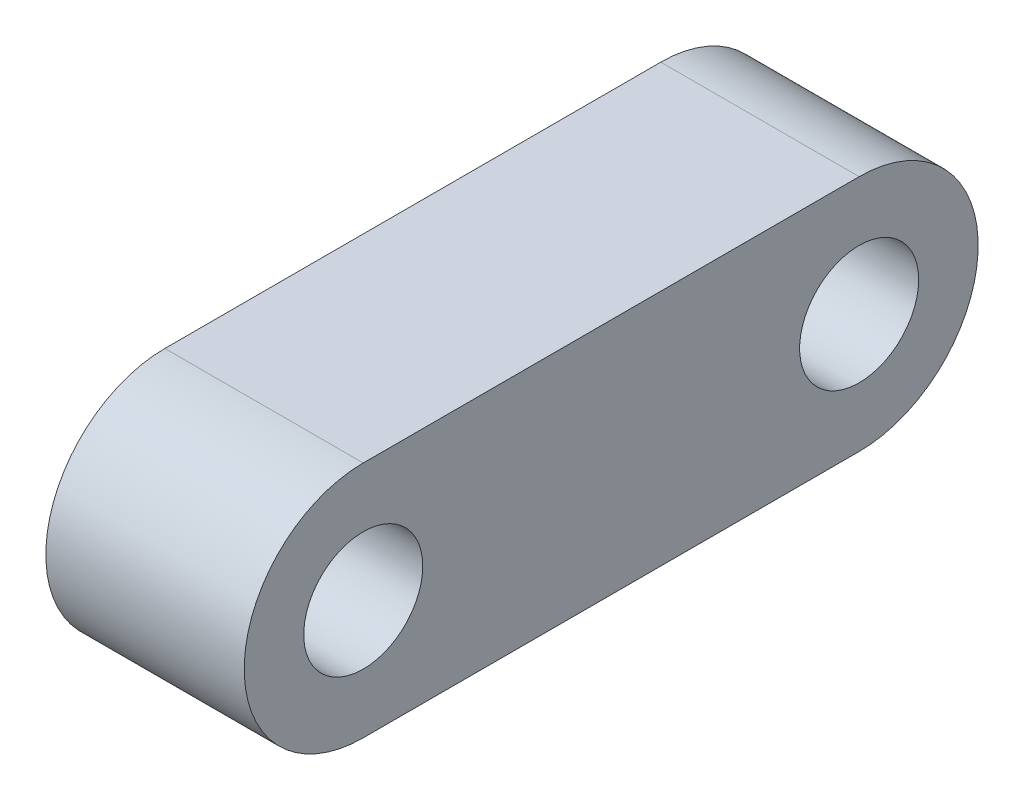
ISO-10303-21;
HEADER;
FILE_DESCRIPTION(('STEP AP214'),'2;1');
FILE_NAME('part.step','',(''),(''),'','','');
FILE_SCHEMA(('AUTOMOTIVE_DESIGN { 1 0 10303 214 1 1 1 1 }'));
ENDSEC;
DATA;
#1=APPLICATION_CONTEXT('core data for automotive mechanical design processes');
#2=APPLICATION_PROTOCOL_DEFINITION('international standard','automotive_design',2000,#1);
#3=PRODUCT_CONTEXT('',#1,'mechanical');
#4=PRODUCT('Part','Part','',(#3));
#5=PRODUCT_RELATED_PRODUCT_CATEGORY('part','',(#4));
#6=PRODUCT_DEFINITION_FORMATION('','',#4);
#7=PRODUCT_DEFINITION_CONTEXT('part definition',#1,'design');
#8=PRODUCT_DEFINITION('design','',#6,#7);
#9=PRODUCT_DEFINITION_SHAPE('','',#8);
#10=(LENGTH_UNIT() NAMED_UNIT(*) SI_UNIT(.MILLI.,.METRE.));
#11=(NAMED_UNIT(*) PLANE_ANGLE_UNIT() SI_UNIT($,.RADIAN.));
#12=(NAMED_UNIT(*) SI_UNIT($,.STERADIAN.) SOLID_ANGLE_UNIT());
#13=UNCERTAINTY_MEASURE_WITH_UNIT(LENGTH_MEASURE(1.E-05),#10,'distance_accuracy_value','');
#14=(GEOMETRIC_REPRESENTATION_CONTEXT(3) GLOBAL_UNCERTAINTY_ASSIGNED_CONTEXT((#13)) GLOBAL_UNIT_ASSIGNED_CONTEXT((#10,
#11,#12)) REPRESENTATION_CONTEXT('',''));
#15=CARTESIAN_POINT('',(0.,0.,0.));
#16=DIRECTION('',(0.,0.,1.));
#17=DIRECTION('',(1.,0.,0.));
#18=AXIS2_PLACEMENT_3D('',#15,#16,#17);
#19=CARTESIAN_POINT('',(2.5,0.,6.25));
#20=DIRECTION('',(1.,0.,0.));
#21=DIRECTION('',(0.,0.,-1.));
#22=AXIS2_PLACEMENT_3D('',#19,#20,#21);
#23=PLANE('',#22);
#24=CARTESIAN_POINT('',(2.5,0.,-6.25));
#25=DIRECTION('',(1.,0.,0.));
#26=DIRECTION('',(0.,0.,-1.));
#27=AXIS2_PLACEMENT_3D('',#24,#25,#26);
#28=CIRCLE('',#27,1.5);
#29=CARTESIAN_POINT('',(2.5,0.,-7.75));
#30=VERTEX_POINT('',#29);
#31=EDGE_CURVE('E106',#30,#30,#28,.T.);
#32=ORIENTED_EDGE('',*,*,#31,.F.);
#33=EDGE_LOOP('',(#32));
#34=FACE_BOUND('',#33,.T.);
#35=CARTESIAN_POINT('',(2.5,0.,6.25));
#36=DIRECTION('',(1.,0.,0.));
#37=DIRECTION('',(0.,0.,-1.));
#38=AXIS2_PLACEMENT_3D('',#35,#36,#37);
#39=CIRCLE('',#38,3.);
#40=CARTESIAN_POINT('',(2.5,3.,6.25));
#41=VERTEX_POINT('',#40);
#42=CARTESIAN_POINT('',(2.5,-3.,6.25));
#43=VERTEX_POINT('',#42);
#44=EDGE_CURVE('E91',#41,#43,#39,.T.);
#45=ORIENTED_EDGE('',*,*,#44,.T.);
#46=DIRECTION('',(0.,0.,-1.));
#47=VECTOR('',#46,1.);
#48=CARTESIAN_POINT('',(2.5,-3.,6.25));
#49=LINE('',#48,#47);
#50=CARTESIAN_POINT('',(2.5,-3.,-6.25));
#51=VERTEX_POINT('',#50);
#52=EDGE_CURVE('E86',#43,#51,#49,.T.);
#53=ORIENTED_EDGE('',*,*,#52,.T.);
#54=CARTESIAN_POINT('',(2.5,0.,-6.25));
#55=DIRECTION('',(1.,0.,0.));
#56=DIRECTION('',(0.,0.,-1.));
#57=AXIS2_PLACEMENT_3D('',#54,#55,#56);
#58=CIRCLE('',#57,3.);
#59=CARTESIAN_POINT('',(2.5,3.,-6.25));
#60=VERTEX_POINT('',#59);
#61=EDGE_CURVE('E89',#51,#60,#58,.T.);
#62=ORIENTED_EDGE('',*,*,#61,.T.);
#63=DIRECTION('',(0.,0.,1.));
#64=VECTOR('',#63,1.);
#65=CARTESIAN_POINT('',(2.5,3.,6.25));
#66=LINE('',#65,#64);
#67=EDGE_CURVE('E56',#60,#41,#66,.T.);
#68=ORIENTED_EDGE('',*,*,#67,.T.);
#69=EDGE_LOOP('',(#45,#53,#62,#68));
#70=FACE_BOUND('',#69,.T.);
#71=CARTESIAN_POINT('',(2.5,0.,6.25));
#72=DIRECTION('',(1.,0.,0.));
#73=DIRECTION('',(0.,0.,-1.));
#74=AXIS2_PLACEMENT_3D('',#71,#72,#73);
#75=CIRCLE('',#74,1.5);
#76=CARTESIAN_POINT('',(2.5,0.,4.75));
#77=VERTEX_POINT('',#76);
#78=EDGE_CURVE('E121',#77,#77,#75,.T.);
#79=ORIENTED_EDGE('',*,*,#78,.F.);
#80=EDGE_LOOP('',(#79));
#81=FACE_BOUND('',#80,.T.);
#82=ADVANCED_FACE('F39',(#34,#70,#81),#23,.T.);
#83=CARTESIAN_POINT('',(-2.5,0.,6.25));
#84=DIRECTION('',(1.,0.,0.));
#85=DIRECTION('',(0.,0.,-1.));
#86=AXIS2_PLACEMENT_3D('',#83,#84,#85);
#87=PLANE('',#86);
#88=CARTESIAN_POINT('',(-2.5,0.,6.25));
#89=DIRECTION('',(1.,0.,0.));
#90=DIRECTION('',(0.,0.,-1.));
#91=AXIS2_PLACEMENT_3D('',#88,#89,#90);
#92=CIRCLE('',#91,3.);
#93=CARTESIAN_POINT('',(-2.5,3.,6.25));
#94=VERTEX_POINT('',#93);
#95=CARTESIAN_POINT('',(-2.5,-3.,6.25));
#96=VERTEX_POINT('',#95);
#97=EDGE_CURVE('E103',#94,#96,#92,.T.);
#98=ORIENTED_EDGE('',*,*,#97,.F.);
#99=DIRECTION('',(0.,0.,1.));
#100=VECTOR('',#99,1.);
#101=CARTESIAN_POINT('',(-2.5,3.,6.25));
#102=LINE('',#101,#100);
#103=CARTESIAN_POINT('',(-2.5,3.,-6.25));
#104=VERTEX_POINT('',#103);
#105=EDGE_CURVE('E79',#104,#94,#102,.T.);
#106=ORIENTED_EDGE('',*,*,#105,.F.);
#107=CARTESIAN_POINT('',(-2.5,0.,-6.25));
#108=DIRECTION('',(1.,0.,0.));
#109=DIRECTION('',(0.,0.,-1.));
#110=AXIS2_PLACEMENT_3D('',#107,#108,#109);
#111=CIRCLE('',#110,3.);
#112=CARTESIAN_POINT('',(-2.5,-3.,-6.25));
#113=VERTEX_POINT('',#112);
#114=EDGE_CURVE('E73',#113,#104,#111,.T.);
#115=ORIENTED_EDGE('',*,*,#114,.F.);
#116=DIRECTION('',(0.,0.,-1.));
#117=VECTOR('',#116,1.);
#118=CARTESIAN_POINT('',(-2.5,-3.,6.25));
#119=LINE('',#118,#117);
#120=EDGE_CURVE('E95',#96,#113,#119,.T.);
#121=ORIENTED_EDGE('',*,*,#120,.F.);
#122=EDGE_LOOP('',(#98,#106,#115,#121));
#123=FACE_BOUND('',#122,.T.);
#124=CARTESIAN_POINT('',(-2.5,0.,-6.25));
#125=DIRECTION('',(1.,0.,0.));
#126=DIRECTION('',(0.,0.,-1.));
#127=AXIS2_PLACEMENT_3D('',#124,#125,#126);
#128=CIRCLE('',#127,1.5);
#129=CARTESIAN_POINT('',(-2.5,0.,-7.75));
#130=VERTEX_POINT('',#129);
#131=EDGE_CURVE('E118',#130,#130,#128,.T.);
#132=ORIENTED_EDGE('',*,*,#131,.T.);
#133=EDGE_LOOP('',(#132));
#134=FACE_BOUND('',#133,.T.);
#135=CARTESIAN_POINT('',(-2.5,0.,6.25));
#136=DIRECTION('',(1.,0.,0.));
#137=DIRECTION('',(0.,0.,-1.));
#138=AXIS2_PLACEMENT_3D('',#135,#136,#137);
#139=CIRCLE('',#138,1.5);
#140=CARTESIAN_POINT('',(-2.5,0.,4.75));
#141=VERTEX_POINT('',#140);
#142=EDGE_CURVE('E124',#141,#141,#139,.T.);
#143=ORIENTED_EDGE('',*,*,#142,.T.);
#144=EDGE_LOOP('',(#143));
#145=FACE_BOUND('',#144,.T.);
#146=ADVANCED_FACE('F114',(#123,#134,#145),#87,.F.);
#147=CARTESIAN_POINT('',(2.5,0.,6.25));
#148=DIRECTION('',(-1.,0.,0.));
#149=DIRECTION('',(0.,0.,1.));
#150=AXIS2_PLACEMENT_3D('',#147,#148,#149);
#151=CYLINDRICAL_SURFACE('',#150,3.);
#152=ORIENTED_EDGE('',*,*,#97,.T.);
#153=DIRECTION('',(-1.,0.,0.));
#154=VECTOR('',#153,1.);
#155=CARTESIAN_POINT('',(2.5,-3.,6.25));
#156=LINE('',#155,#154);
#157=EDGE_CURVE('E11',#43,#96,#156,.T.);
#158=ORIENTED_EDGE('',*,*,#157,.F.);
#159=ORIENTED_EDGE('',*,*,#44,.F.);
#160=DIRECTION('',(-1.,0.,0.));
#161=VECTOR('',#160,1.);
#162=CARTESIAN_POINT('',(2.5,3.,6.25));
#163=LINE('',#162,#161);
#164=EDGE_CURVE('E99',#41,#94,#163,.T.);
#165=ORIENTED_EDGE('',*,*,#164,.T.);
#166=EDGE_LOOP('',(#152,#158,#159,#165));
#167=FACE_BOUND('',#166,.T.);
#168=ADVANCED_FACE('F41',(#167),#151,.T.);
#169=CARTESIAN_POINT('',(2.5,-3.,6.25));
#170=DIRECTION('',(0.,1.,0.));
#171=DIRECTION('',(0.,0.,1.));
#172=AXIS2_PLACEMENT_3D('',#169,#170,#171);
#173=PLANE('',#172);
#174=ORIENTED_EDGE('',*,*,#120,.T.);
#175=DIRECTION('',(-1.,0.,0.));
#176=VECTOR('',#175,1.);
#177=CARTESIAN_POINT('',(2.5,-3.,-6.25));
#178=LINE('',#177,#176);
#179=EDGE_CURVE('E48',#51,#113,#178,.T.);
#180=ORIENTED_EDGE('',*,*,#179,.F.);
#181=ORIENTED_EDGE('',*,*,#52,.F.);
#182=ORIENTED_EDGE('',*,*,#157,.T.);
#183=EDGE_LOOP('',(#174,#180,#181,#182));
#184=FACE_BOUND('',#183,.T.);
#185=ADVANCED_FACE('F94',(#184),#173,.F.);
#186=CARTESIAN_POINT('',(2.5,0.,-6.25));
#187=DIRECTION('',(-1.,0.,0.));
#188=DIRECTION('',(0.,0.,1.));
#189=AXIS2_PLACEMENT_3D('',#186,#187,#188);
#190=CYLINDRICAL_SURFACE('',#189,3.);
#191=ORIENTED_EDGE('',*,*,#114,.T.);
#192=DIRECTION('',(-1.,0.,0.));
#193=VECTOR('',#192,1.);
#194=CARTESIAN_POINT('',(2.5,3.,-6.25));
#195=LINE('',#194,#193);
#196=EDGE_CURVE('E96',#60,#104,#195,.T.);
#197=ORIENTED_EDGE('',*,*,#196,.F.);
#198=ORIENTED_EDGE('',*,*,#61,.F.);
#199=ORIENTED_EDGE('',*,*,#179,.T.);
#200=EDGE_LOOP('',(#191,#197,#198,#199));
#201=FACE_BOUND('',#200,.T.);
#202=ADVANCED_FACE('F97',(#201),#190,.T.);
#203=CARTESIAN_POINT('',(2.5,3.,6.25));
#204=DIRECTION('',(0.,-1.,0.));
#205=DIRECTION('',(0.,0.,-1.));
#206=AXIS2_PLACEMENT_3D('',#203,#204,#205);
#207=PLANE('',#206);
#208=ORIENTED_EDGE('',*,*,#105,.T.);
#209=ORIENTED_EDGE('',*,*,#164,.F.);
#210=ORIENTED_EDGE('',*,*,#67,.F.);
#211=ORIENTED_EDGE('',*,*,#196,.T.);
#212=EDGE_LOOP('',(#208,#209,#210,#211));
#213=FACE_BOUND('',#212,.T.);
#214=ADVANCED_FACE('F111',(#213),#207,.F.);
#215=CARTESIAN_POINT('',(2.5,0.,-6.25));
#216=DIRECTION('',(-1.,0.,0.));
#217=DIRECTION('',(0.,0.,1.));
#218=AXIS2_PLACEMENT_3D('',#215,#216,#217);
#219=CYLINDRICAL_SURFACE('',#218,1.5);
#220=ORIENTED_EDGE('',*,*,#31,.T.);
#221=EDGE_LOOP('',(#220));
#222=FACE_BOUND('',#221,.T.);
#223=ORIENTED_EDGE('',*,*,#131,.F.);
#224=EDGE_LOOP('',(#223));
#225=FACE_BOUND('',#224,.T.);
#226=ADVANCED_FACE('F141',(#222,#225),#219,.F.);
#227=CARTESIAN_POINT('',(2.5,0.,6.25));
#228=DIRECTION('',(-1.,0.,0.));
#229=DIRECTION('',(0.,0.,1.));
#230=AXIS2_PLACEMENT_3D('',#227,#228,#229);
#231=CYLINDRICAL_SURFACE('',#230,1.5);
#232=ORIENTED_EDGE('',*,*,#78,.T.);
#233=EDGE_LOOP('',(#232));
#234=FACE_BOUND('',#233,.T.);
#235=ORIENTED_EDGE('',*,*,#142,.F.);
#236=EDGE_LOOP('',(#235));
#237=FACE_BOUND('',#236,.T.);
#238=ADVANCED_FACE('F130',(#234,#237),#231,.F.);
#239=CLOSED_SHELL('',(#82,#146,#168,#185,#202,#214,#226,#238));
#240=MANIFOLD_SOLID_BREP('B2',#239);
#241=ADVANCED_BREP_SHAPE_REPRESENTATION('',(#18,#240),#14);
#242=SHAPE_DEFINITION_REPRESENTATION(#9,#241);
ENDSEC;
END-ISO-10303-21;
